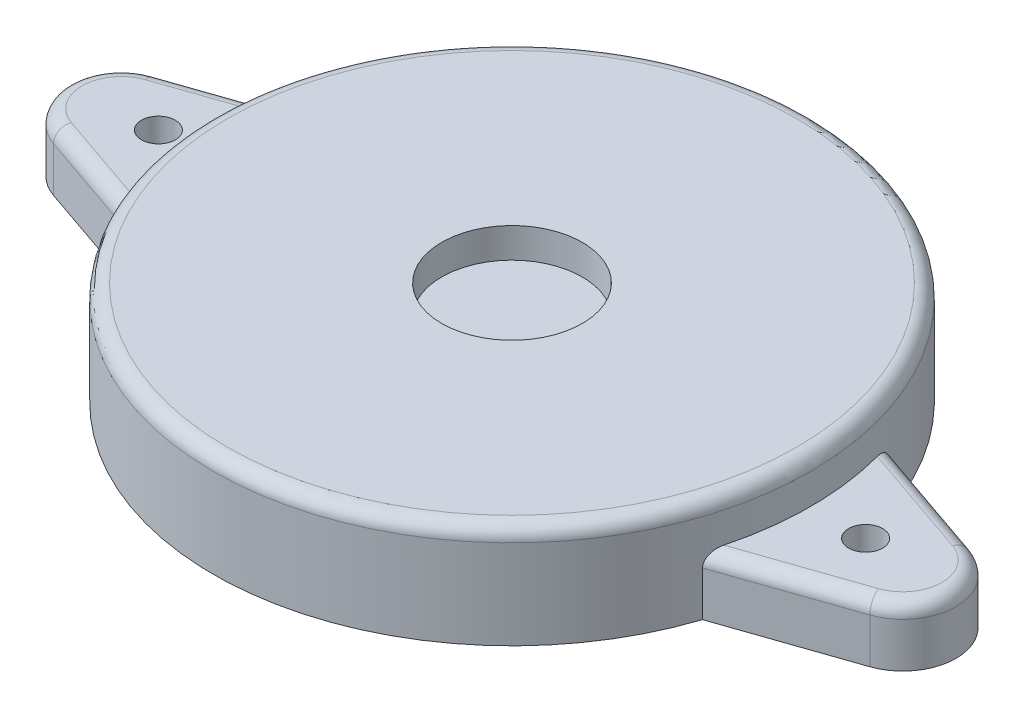
ISO-10303-21;
HEADER;
FILE_DESCRIPTION(('STEP AP214'),'2;1');
FILE_NAME('part.step','',(''),(''),'','','');
FILE_SCHEMA(('AUTOMOTIVE_DESIGN { 1 0 10303 214 1 1 1 1 }'));
ENDSEC;
DATA;
#1=APPLICATION_CONTEXT('core data for automotive mechanical design processes');
#2=APPLICATION_PROTOCOL_DEFINITION('international standard','automotive_design',2000,#1);
#3=PRODUCT_CONTEXT('',#1,'mechanical');
#4=PRODUCT('Part','Part','',(#3));
#5=PRODUCT_RELATED_PRODUCT_CATEGORY('part','',(#4));
#6=PRODUCT_DEFINITION_FORMATION('','',#4);
#7=PRODUCT_DEFINITION_CONTEXT('part definition',#1,'design');
#8=PRODUCT_DEFINITION('design','',#6,#7);
#9=PRODUCT_DEFINITION_SHAPE('','',#8);
#10=(LENGTH_UNIT() NAMED_UNIT(*) SI_UNIT(.MILLI.,.METRE.));
#11=(NAMED_UNIT(*) PLANE_ANGLE_UNIT() SI_UNIT($,.RADIAN.));
#12=(NAMED_UNIT(*) SI_UNIT($,.STERADIAN.) SOLID_ANGLE_UNIT());
#13=UNCERTAINTY_MEASURE_WITH_UNIT(LENGTH_MEASURE(1.E-05),#10,'distance_accuracy_value','');
#14=(GEOMETRIC_REPRESENTATION_CONTEXT(3) GLOBAL_UNCERTAINTY_ASSIGNED_CONTEXT((#13)) GLOBAL_UNIT_ASSIGNED_CONTEXT((#10,
#11,#12)) REPRESENTATION_CONTEXT('',''));
#15=CARTESIAN_POINT('',(0.,0.,0.));
#16=DIRECTION('',(0.,0.,1.));
#17=DIRECTION('',(1.,0.,0.));
#18=AXIS2_PLACEMENT_3D('',#15,#16,#17);
#19=CARTESIAN_POINT('',(0.,5.16,0.));
#20=DIRECTION('',(0.,-1.,0.));
#21=DIRECTION('',(0.,0.,-1.));
#22=AXIS2_PLACEMENT_3D('',#19,#20,#21);
#23=CYLINDRICAL_SURFACE('',#22,14.93);
#24=CARTESIAN_POINT('',(0.,4.46,0.));
#25=DIRECTION('',(0.,1.,0.));
#26=DIRECTION('',(0.,0.,1.));
#27=AXIS2_PLACEMENT_3D('',#24,#25,#26);
#28=CIRCLE('',#27,14.93);
#29=CARTESIAN_POINT('',(0.,4.46,14.93));
#30=VERTEX_POINT('',#29);
#31=EDGE_CURVE('E202',#30,#30,#28,.F.);
#32=ORIENTED_EDGE('',*,*,#31,.T.);
#33=EDGE_LOOP('',(#32));
#34=FACE_BOUND('',#33,.T.);
#35=CARTESIAN_POINT('',(0.,2.94,0.));
#36=DIRECTION('',(0.,-1.,0.));
#37=DIRECTION('',(0.,0.,-1.));
#38=AXIS2_PLACEMENT_3D('',#35,#36,#37);
#39=CIRCLE('',#38,14.93);
#40=CARTESIAN_POINT('',(-14.429087598297,2.94,3.8348834507287));
#41=VERTEX_POINT('',#40);
#42=CARTESIAN_POINT('',(-14.429087598297,2.94,-3.8348834507287));
#43=VERTEX_POINT('',#42);
#44=EDGE_CURVE('E163',#41,#43,#39,.T.);
#45=ORIENTED_EDGE('',*,*,#44,.F.);
#46=CARTESIAN_POINT('',(-14.429087598297,2.94,3.8348834507287));
#47=CARTESIAN_POINT('',(-14.4138774173166,2.93997814055828,3.8921743099573));
#48=CARTESIAN_POINT('',(-14.3982845537592,2.93480887956589,3.94941011262203));
#49=CARTESIAN_POINT('',(-14.3667965768096,2.91417210982097,4.06243771924972));
#50=CARTESIAN_POINT('',(-14.3509000239146,2.89861824672489,4.11821330467232));
#51=CARTESIAN_POINT('',(-14.3202531008862,2.85814754029159,4.22352402585155));
#52=CARTESIAN_POINT('',(-14.305483406981,2.83368591733759,4.2732273044714));
#53=CARTESIAN_POINT('',(-14.2771239902179,2.77541682636606,4.3670362653395));
#54=CARTESIAN_POINT('',(-14.2635295644546,2.74164911083228,4.41116461783673));
#55=CARTESIAN_POINT('',(-14.242478513252,2.67726120224456,4.47856390047529));
#56=CARTESIAN_POINT('',(-14.2344480605328,2.64907861241899,4.50399564814046));
#57=CARTESIAN_POINT('',(-14.219760478293,2.58871728969254,4.5501534800078));
#58=CARTESIAN_POINT('',(-14.2131033739341,2.5565384835928,4.57087947799488));
#59=CARTESIAN_POINT('',(-14.2015511147571,2.48845281904667,4.60664798740863));
#60=CARTESIAN_POINT('',(-14.1966728144079,2.45251425129202,4.6216361955794));
#61=CARTESIAN_POINT('',(-14.1892028208415,2.37825680983918,4.64452074193722));
#62=CARTESIAN_POINT('',(-14.1866043877521,2.33994531310194,4.65243798496127));
#63=CARTESIAN_POINT('',(-14.1849214181625,2.29108472920955,4.6575642029491));
#64=CARTESIAN_POINT('',(-14.1846584788022,2.28087987559489,4.6583649206828));
#65=CARTESIAN_POINT('',(-14.1843080413889,2.26045175313608,4.65943195312917));
#66=CARTESIAN_POINT('',(-14.184220329351,2.25022852203119,4.659698919651));
#67=CARTESIAN_POINT('',(-14.1842199529482,2.24,4.65970002536481));
#68=B_SPLINE_CURVE_WITH_KNOTS('',3,(#46,#47,#48,#49,#50,#51,#52,#53,#54,#55,#56,#57,#58,#59,#60,
#61,#62,#63,#64,#65,#66,#67),.UNSPECIFIED.,.F.,.F.,(4,2,2,2,2,2,2,2,2,2,4),(0.,
0.177689420451845,0.356875152519502,0.527957754312332,0.698320583460933,0.814287444919781,
0.930256430862166,1.04729732013803,1.16399102929701,1.19469972106421,1.22537088886555),.UNSPECIFIED.);
#69=CARTESIAN_POINT('',(-14.1842199529482,2.24,4.65970002536481));
#70=VERTEX_POINT('',#69);
#71=EDGE_CURVE('E46',#41,#70,#68,.T.);
#72=ORIENTED_EDGE('',*,*,#71,.T.);
#73=DIRECTION('',(0.,-1.,0.));
#74=VECTOR('',#73,1.);
#75=CARTESIAN_POINT('',(-14.1842199529482,2.94,4.65970002536481));
#76=LINE('',#75,#74);
#77=CARTESIAN_POINT('',(-14.1842199529482,0.,4.65970002536481));
#78=VERTEX_POINT('',#77);
#79=EDGE_CURVE('E138',#70,#78,#76,.T.);
#80=ORIENTED_EDGE('',*,*,#79,.T.);
#81=CARTESIAN_POINT('',(0.,0.,0.));
#82=DIRECTION('',(0.,1.,0.));
#83=DIRECTION('',(0.,0.,1.));
#84=AXIS2_PLACEMENT_3D('',#81,#82,#83);
#85=CIRCLE('',#84,14.93);
#86=CARTESIAN_POINT('',(14.1842199529483,0.,4.65970002536481));
#87=VERTEX_POINT('',#86);
#88=EDGE_CURVE('E150',#78,#87,#85,.T.);
#89=ORIENTED_EDGE('',*,*,#88,.T.);
#90=DIRECTION('',(0.,-1.,0.));
#91=VECTOR('',#90,1.);
#92=CARTESIAN_POINT('',(14.1842199529482,2.94,4.65970002536481));
#93=LINE('',#92,#91);
#94=CARTESIAN_POINT('',(14.1842199529482,2.24,4.65970002536481));
#95=VERTEX_POINT('',#94);
#96=EDGE_CURVE('E194',#95,#87,#93,.T.);
#97=ORIENTED_EDGE('',*,*,#96,.F.);
#98=CARTESIAN_POINT('',(14.1842199529482,2.24,4.65970002536481));
#99=CARTESIAN_POINT('',(14.1842190896717,2.25693649452195,4.65970201646287));
#100=CARTESIAN_POINT('',(14.184461026523,2.27386343904716,4.6589662491817));
#101=CARTESIAN_POINT('',(14.1854202016541,2.30756925031859,4.65604524308534));
#102=CARTESIAN_POINT('',(14.1861371831797,2.32434819209661,4.65386078726296));
#103=CARTESIAN_POINT('',(14.1889722437595,2.37406195090137,4.64521313316511));
#104=CARTESIAN_POINT('',(14.1917747600945,2.40661629321092,4.63665481022352));
#105=CARTESIAN_POINT('',(14.1989974675529,2.46965652039576,4.61448848816677));
#106=CARTESIAN_POINT('',(14.2034147720633,2.50014598190755,4.60088949919917));
#107=CARTESIAN_POINT('',(14.2135990146769,2.55856601677584,4.5693300993658));
#108=CARTESIAN_POINT('',(14.219367887,2.58649284229407,4.55136343655123));
#109=CARTESIAN_POINT('',(14.2324496611259,2.64139553893826,4.5102964837884));
#110=CARTESIAN_POINT('',(14.239847031579,2.66813434631393,4.48690821546017));
#111=CARTESIAN_POINT('',(14.255543759827,2.71792964715898,4.4367851705581));
#112=CARTESIAN_POINT('',(14.2638433119251,2.74098534474529,4.41004967290192));
#113=CARTESIAN_POINT('',(14.282757982286,2.78748441236427,4.34844257702542));
#114=CARTESIAN_POINT('',(14.2935083015561,2.81011977276594,4.3130029102126));
#115=CARTESIAN_POINT('',(14.3155306560991,2.84999580013863,4.23933536231764));
#116=CARTESIAN_POINT('',(14.326803306577,2.86722991003768,4.2011041611923));
#117=CARTESIAN_POINT('',(14.3516786781012,2.89899127627244,4.11540518367075));
#118=CARTESIAN_POINT('',(14.3653248558078,2.91241908179589,4.06754191138568));
#119=CARTESIAN_POINT('',(14.3924909249222,2.93160860206077,3.97034534492567));
#120=CARTESIAN_POINT('',(14.4060109908642,2.93738324223114,3.92101467352165));
#121=CARTESIAN_POINT('',(14.4225769534227,2.9397641173255,3.85931833082634));
#122=CARTESIAN_POINT('',(14.4258406872819,2.94000004110343,3.8471010798203));
#123=CARTESIAN_POINT('',(14.429087598297,2.94,3.8348834507287));
#124=B_SPLINE_CURVE_WITH_KNOTS('',3,(#98,#99,#100,#101,#102,#103,#104,#105,#106,#107,#108,#109,
#110,#111,#112,#113,#114,#115,#116,#117,#118,#119,#120,#121,#122,#123),.UNSPECIFIED.,.F.,.F.,(4,
2,2,2,2,2,2,2,2,2,2,2,4),(0.,0.0507734722109093,0.101519524519104,0.202294433131119,
0.302890069371643,0.403630556349275,0.512094664936698,0.620582179917424,0.750311736923561,
0.880198179861179,1.03423986539473,1.18802105701897,1.22595505623296),.UNSPECIFIED.);
#125=CARTESIAN_POINT('',(14.429087598297,2.94,3.8348834507287));
#126=VERTEX_POINT('',#125);
#127=EDGE_CURVE('E11',#95,#126,#124,.T.);
#128=ORIENTED_EDGE('',*,*,#127,.T.);
#129=CARTESIAN_POINT('',(0.,2.94,0.));
#130=DIRECTION('',(0.,-1.,0.));
#131=DIRECTION('',(0.,0.,1.));
#132=AXIS2_PLACEMENT_3D('',#129,#130,#131);
#133=CIRCLE('',#132,14.93);
#134=CARTESIAN_POINT('',(14.429087598297,2.94,-3.8348834507287));
#135=VERTEX_POINT('',#134);
#136=EDGE_CURVE('E177',#135,#126,#133,.T.);
#137=ORIENTED_EDGE('',*,*,#136,.F.);
#138=CARTESIAN_POINT('',(14.429087598297,2.94,-3.8348834507287));
#139=CARTESIAN_POINT('',(14.4138774173166,2.93997814055828,-3.8921743099573));
#140=CARTESIAN_POINT('',(14.3982845537592,2.93480887956589,-3.94941011262203));
#141=CARTESIAN_POINT('',(14.3667965768096,2.91417210982097,-4.06243771924972));
#142=CARTESIAN_POINT('',(14.3509000239146,2.89861824672489,-4.11821330467232));
#143=CARTESIAN_POINT('',(14.3202531008862,2.85814754029159,-4.22352402585155));
#144=CARTESIAN_POINT('',(14.305483406981,2.83368591733758,-4.2732273044714));
#145=CARTESIAN_POINT('',(14.2771239902179,2.77541682636606,-4.3670362653395));
#146=CARTESIAN_POINT('',(14.2635295644546,2.74164911083227,-4.41116461783674));
#147=CARTESIAN_POINT('',(14.242478513252,2.67726120224456,-4.47856390047529));
#148=CARTESIAN_POINT('',(14.2344480605328,2.64907861241899,-4.50399564814046));
#149=CARTESIAN_POINT('',(14.219760478293,2.58871728969254,-4.5501534800078));
#150=CARTESIAN_POINT('',(14.2131033739341,2.5565384835928,-4.57087947799488));
#151=CARTESIAN_POINT('',(14.2015511147571,2.48845281904666,-4.60664798740864));
#152=CARTESIAN_POINT('',(14.1966728144079,2.45251425129201,-4.6216361955794));
#153=CARTESIAN_POINT('',(14.1892028208415,2.37825680983918,-4.64452074193722));
#154=CARTESIAN_POINT('',(14.1866043877521,2.33994531310193,-4.65243798496127));
#155=CARTESIAN_POINT('',(14.1849214181625,2.29108472920955,-4.6575642029491));
#156=CARTESIAN_POINT('',(14.1846584788022,2.28087987559489,-4.6583649206828));
#157=CARTESIAN_POINT('',(14.1843080413889,2.26045175313608,-4.65943195312917));
#158=CARTESIAN_POINT('',(14.184220329351,2.25022852203119,-4.659698919651));
#159=CARTESIAN_POINT('',(14.1842199529482,2.24,-4.65970002536481));
#160=B_SPLINE_CURVE_WITH_KNOTS('',3,(#138,#139,#140,#141,#142,#143,#144,#145,#146,#147,#148,
#149,#150,#151,#152,#153,#154,#155,#156,#157,#158,#159),.UNSPECIFIED.,.F.,.F.,(4,2,2,2,2,2,2,2,
2,2,4),(0.,0.177689420451847,0.356875152519503,0.527957754312334,0.698320583460934,
0.814287444919785,0.930256430862171,1.04729732013804,1.16399102929701,1.19469972106422,
1.22537088886555),.UNSPECIFIED.);
#161=CARTESIAN_POINT('',(14.1842199529482,2.24,-4.65970002536481));
#162=VERTEX_POINT('',#161);
#163=EDGE_CURVE('E237',#135,#162,#160,.T.);
#164=ORIENTED_EDGE('',*,*,#163,.T.);
#165=DIRECTION('',(0.,-1.,0.));
#166=VECTOR('',#165,1.);
#167=CARTESIAN_POINT('',(14.1842199529482,2.94,-4.65970002536481));
#168=LINE('',#167,#166);
#169=CARTESIAN_POINT('',(14.1842199529482,0.,-4.65970002536481));
#170=VERTEX_POINT('',#169);
#171=EDGE_CURVE('E180',#162,#170,#168,.T.);
#172=ORIENTED_EDGE('',*,*,#171,.T.);
#173=CARTESIAN_POINT('',(-14.1842199529483,0.,-4.65970002536481));
#174=VERTEX_POINT('',#173);
#175=EDGE_CURVE('E196',#170,#174,#85,.T.);
#176=ORIENTED_EDGE('',*,*,#175,.T.);
#177=DIRECTION('',(0.,-1.,0.));
#178=VECTOR('',#177,1.);
#179=CARTESIAN_POINT('',(-14.1842199529482,2.94,-4.65970002536481));
#180=LINE('',#179,#178);
#181=CARTESIAN_POINT('',(-14.1842199529482,2.24,-4.65970002536481));
#182=VERTEX_POINT('',#181);
#183=EDGE_CURVE('E168',#182,#174,#180,.T.);
#184=ORIENTED_EDGE('',*,*,#183,.F.);
#185=CARTESIAN_POINT('',(-14.1842199529482,2.24,-4.65970002536481));
#186=CARTESIAN_POINT('',(-14.1842190896717,2.25693649452195,-4.65970201646287));
#187=CARTESIAN_POINT('',(-14.184461026523,2.27386343904716,-4.6589662491817));
#188=CARTESIAN_POINT('',(-14.1854202016541,2.30756925031859,-4.65604524308534));
#189=CARTESIAN_POINT('',(-14.1861371831797,2.32434819209661,-4.65386078726296));
#190=CARTESIAN_POINT('',(-14.1889722437595,2.37406195090137,-4.64521313316511));
#191=CARTESIAN_POINT('',(-14.1917747600945,2.40661629321092,-4.63665481022352));
#192=CARTESIAN_POINT('',(-14.1989974675529,2.46965652039576,-4.61448848816677));
#193=CARTESIAN_POINT('',(-14.2034147720633,2.50014598190755,-4.60088949919916));
#194=CARTESIAN_POINT('',(-14.2135990146769,2.55856601677584,-4.5693300993658));
#195=CARTESIAN_POINT('',(-14.219367887,2.58649284229407,-4.55136343655123));
#196=CARTESIAN_POINT('',(-14.2324496611259,2.64139553893826,-4.5102964837884));
#197=CARTESIAN_POINT('',(-14.239847031579,2.66813434631393,-4.48690821546017));
#198=CARTESIAN_POINT('',(-14.255543759827,2.71792964715898,-4.4367851705581));
#199=CARTESIAN_POINT('',(-14.2638433119251,2.74098534474529,-4.41004967290191));
#200=CARTESIAN_POINT('',(-14.282757982286,2.78748441236427,-4.34844257702541));
#201=CARTESIAN_POINT('',(-14.2935083015561,2.81011977276594,-4.3130029102126));
#202=CARTESIAN_POINT('',(-14.3155306560991,2.84999580013863,-4.23933536231764));
#203=CARTESIAN_POINT('',(-14.326803306577,2.86722991003768,-4.2011041611923));
#204=CARTESIAN_POINT('',(-14.3516786781012,2.89899127627244,-4.11540518367075));
#205=CARTESIAN_POINT('',(-14.3653248558078,2.91241908179589,-4.06754191138568));
#206=CARTESIAN_POINT('',(-14.3924909249222,2.93160860206077,-3.97034534492567));
#207=CARTESIAN_POINT('',(-14.4060109908642,2.93738324223114,-3.92101467352165));
#208=CARTESIAN_POINT('',(-14.4225769534227,2.9397641173255,-3.85931833082634));
#209=CARTESIAN_POINT('',(-14.4258406872819,2.94000004110343,-3.8471010798203));
#210=CARTESIAN_POINT('',(-14.429087598297,2.94,-3.8348834507287));
#211=B_SPLINE_CURVE_WITH_KNOTS('',3,(#185,#186,#187,#188,#189,#190,#191,#192,#193,#194,#195,
#196,#197,#198,#199,#200,#201,#202,#203,#204,#205,#206,#207,#208,#209,#210),.UNSPECIFIED.,.F.,
.F.,(4,2,2,2,2,2,2,2,2,2,2,2,4),(0.,0.0507734722109094,0.101519524519103,0.202294433131119,
0.302890069371642,0.403630556349275,0.512094664936698,0.620582179917423,0.75031173692356,
0.880198179861176,1.03423986539473,1.18802105701897,1.22595505623296),.UNSPECIFIED.);
#212=EDGE_CURVE('E229',#182,#43,#211,.T.);
#213=ORIENTED_EDGE('',*,*,#212,.T.);
#214=EDGE_LOOP('',(#45,#72,#80,#89,#97,#128,#137,#164,#172,#176,#184,#213));
#215=FACE_BOUND('',#214,.T.);
#216=ADVANCED_FACE('F36',(#34,#215),#23,.T.);
#217=CARTESIAN_POINT('',(0.,5.16,0.));
#218=DIRECTION('',(0.,1.,0.));
#219=DIRECTION('',(0.,0.,1.));
#220=AXIS2_PLACEMENT_3D('',#217,#218,#219);
#221=PLANE('',#220);
#222=CARTESIAN_POINT('',(0.,5.16,0.));
#223=DIRECTION('',(0.,1.,0.));
#224=DIRECTION('',(0.,0.,1.));
#225=AXIS2_PLACEMENT_3D('',#222,#223,#224);
#226=CIRCLE('',#225,3.515);
#227=CARTESIAN_POINT('',(0.,5.16,3.515));
#228=VERTEX_POINT('',#227);
#229=EDGE_CURVE('E285',#228,#228,#226,.T.);
#230=ORIENTED_EDGE('',*,*,#229,.F.);
#231=EDGE_LOOP('',(#230));
#232=FACE_BOUND('',#231,.T.);
#233=CARTESIAN_POINT('',(0.,5.16,0.));
#234=DIRECTION('',(0.,1.,0.));
#235=DIRECTION('',(0.,0.,1.));
#236=AXIS2_PLACEMENT_3D('',#233,#234,#235);
#237=CIRCLE('',#236,14.23);
#238=CARTESIAN_POINT('',(0.,5.16,14.23));
#239=VERTEX_POINT('',#238);
#240=EDGE_CURVE('E199',#239,#239,#237,.T.);
#241=ORIENTED_EDGE('',*,*,#240,.T.);
#242=EDGE_LOOP('',(#241));
#243=FACE_BOUND('',#242,.T.);
#244=ADVANCED_FACE('F310',(#232,#243),#221,.T.);
#245=CARTESIAN_POINT('',(0.,0.,0.));
#246=DIRECTION('',(0.,1.,0.));
#247=DIRECTION('',(0.,0.,1.));
#248=AXIS2_PLACEMENT_3D('',#245,#246,#247);
#249=PLANE('',#248);
#250=ORIENTED_EDGE('',*,*,#175,.F.);
#251=DIRECTION('',(-0.945415498264678,0.,-0.325867358968263));
#252=VECTOR('',#251,1.);
#253=CARTESIAN_POINT('',(14.1842199529482,0.,-4.65970002536481));
#254=LINE('',#253,#252);
#255=CARTESIAN_POINT('',(20.4067284526636,0.,-2.51491562667268));
#256=VERTEX_POINT('',#255);
#257=EDGE_CURVE('E181',#256,#170,#254,.T.);
#258=ORIENTED_EDGE('',*,*,#257,.F.);
#259=CARTESIAN_POINT('',(19.5398832245115,0.,0.));
#260=DIRECTION('',(0.,1.,0.));
#261=DIRECTION('',(0.,0.,1.));
#262=AXIS2_PLACEMENT_3D('',#259,#260,#261);
#263=CIRCLE('',#262,2.66011677541656);
#264=CARTESIAN_POINT('',(20.4067284526636,0.,2.51491562667268));
#265=VERTEX_POINT('',#264);
#266=EDGE_CURVE('E184',#265,#256,#263,.T.);
#267=ORIENTED_EDGE('',*,*,#266,.F.);
#268=DIRECTION('',(0.945415498264678,0.,-0.325867358968263));
#269=VECTOR('',#268,1.);
#270=CARTESIAN_POINT('',(14.1842199529482,0.,4.65970002536481));
#271=LINE('',#270,#269);
#272=EDGE_CURVE('E174',#87,#265,#271,.T.);
#273=ORIENTED_EDGE('',*,*,#272,.F.);
#274=ORIENTED_EDGE('',*,*,#88,.F.);
#275=DIRECTION('',(0.945415498264678,0.,0.325867358968263));
#276=VECTOR('',#275,1.);
#277=CARTESIAN_POINT('',(-14.1842199529482,0.,4.65970002536481));
#278=LINE('',#277,#276);
#279=CARTESIAN_POINT('',(-20.4067284526636,0.,2.51491562667268));
#280=VERTEX_POINT('',#279);
#281=EDGE_CURVE('E131',#280,#78,#278,.T.);
#282=ORIENTED_EDGE('',*,*,#281,.F.);
#283=CARTESIAN_POINT('',(-19.5398832245115,0.,0.));
#284=DIRECTION('',(0.,1.,0.));
#285=DIRECTION('',(0.,0.,-1.));
#286=AXIS2_PLACEMENT_3D('',#283,#284,#285);
#287=CIRCLE('',#286,2.66011677541656);
#288=CARTESIAN_POINT('',(-20.4067284526636,0.,-2.51491562667268));
#289=VERTEX_POINT('',#288);
#290=EDGE_CURVE('E147',#289,#280,#287,.T.);
#291=ORIENTED_EDGE('',*,*,#290,.F.);
#292=DIRECTION('',(-0.945415498264678,0.,0.325867358968263));
#293=VECTOR('',#292,1.);
#294=CARTESIAN_POINT('',(-14.1842199529482,0.,-4.65970002536481));
#295=LINE('',#294,#293);
#296=EDGE_CURVE('E151',#174,#289,#295,.T.);
#297=ORIENTED_EDGE('',*,*,#296,.F.);
#298=EDGE_LOOP('',(#250,#258,#267,#273,#274,#282,#291,#297));
#299=FACE_BOUND('',#298,.T.);
#300=CARTESIAN_POINT('',(17.679999999928,0.,0.));
#301=DIRECTION('',(0.,1.,0.));
#302=DIRECTION('',(0.,0.,1.));
#303=AXIS2_PLACEMENT_3D('',#300,#301,#302);
#304=CIRCLE('',#303,0.85);
#305=CARTESIAN_POINT('',(17.679999999928,0.,0.85));
#306=VERTEX_POINT('',#305);
#307=EDGE_CURVE('E137',#306,#306,#304,.T.);
#308=ORIENTED_EDGE('',*,*,#307,.T.);
#309=EDGE_LOOP('',(#308));
#310=FACE_BOUND('',#309,.T.);
#311=CARTESIAN_POINT('',(-17.679999999928,0.,0.));
#312=DIRECTION('',(0.,1.,0.));
#313=DIRECTION('',(0.,0.,-1.));
#314=AXIS2_PLACEMENT_3D('',#311,#312,#313);
#315=CIRCLE('',#314,0.85);
#316=CARTESIAN_POINT('',(-17.679999999928,0.,-0.849999999999999));
#317=VERTEX_POINT('',#316);
#318=EDGE_CURVE('E160',#317,#317,#315,.T.);
#319=ORIENTED_EDGE('',*,*,#318,.T.);
#320=EDGE_LOOP('',(#319));
#321=FACE_BOUND('',#320,.T.);
#322=ADVANCED_FACE('F144',(#299,#310,#321),#249,.F.);
#323=CARTESIAN_POINT('',(0.,2.94,0.));
#324=DIRECTION('',(0.,1.,0.));
#325=DIRECTION('',(0.,0.,1.));
#326=AXIS2_PLACEMENT_3D('',#323,#324,#325);
#327=PLANE('',#326);
#328=CARTESIAN_POINT('',(19.5398832245115,2.94,0.));
#329=DIRECTION('',(0.,1.,0.));
#330=DIRECTION('',(0.,0.,1.));
#331=AXIS2_PLACEMENT_3D('',#328,#329,#330);
#332=CIRCLE('',#331,1.96011677541656);
#333=CARTESIAN_POINT('',(20.1786213013859,2.94,1.8531247778874));
#334=VERTEX_POINT('',#333);
#335=CARTESIAN_POINT('',(20.1786213013859,2.94,-1.8531247778874));
#336=VERTEX_POINT('',#335);
#337=EDGE_CURVE('E218',#334,#336,#332,.T.);
#338=ORIENTED_EDGE('',*,*,#337,.T.);
#339=DIRECTION('',(-0.945415498264678,0.,-0.325867358968263));
#340=VECTOR('',#339,1.);
#341=CARTESIAN_POINT('',(13.9561128016705,2.94,-3.99790917657953));
#342=LINE('',#341,#340);
#343=EDGE_CURVE('E220',#336,#135,#342,.T.);
#344=ORIENTED_EDGE('',*,*,#343,.T.);
#345=ORIENTED_EDGE('',*,*,#136,.T.);
#346=DIRECTION('',(0.945415498264678,0.,-0.325867358968263));
#347=VECTOR('',#346,1.);
#348=CARTESIAN_POINT('',(20.1786213013859,2.94,1.8531247778874));
#349=LINE('',#348,#347);
#350=EDGE_CURVE('E216',#126,#334,#349,.T.);
#351=ORIENTED_EDGE('',*,*,#350,.T.);
#352=EDGE_LOOP('',(#338,#344,#345,#351));
#353=FACE_BOUND('',#352,.T.);
#354=CARTESIAN_POINT('',(17.679999999928,2.94,0.));
#355=DIRECTION('',(0.,1.,0.));
#356=DIRECTION('',(0.,0.,1.));
#357=AXIS2_PLACEMENT_3D('',#354,#355,#356);
#358=CIRCLE('',#357,0.85);
#359=CARTESIAN_POINT('',(17.679999999928,2.94,0.85));
#360=VERTEX_POINT('',#359);
#361=EDGE_CURVE('E171',#360,#360,#358,.T.);
#362=ORIENTED_EDGE('',*,*,#361,.F.);
#363=EDGE_LOOP('',(#362));
#364=FACE_BOUND('',#363,.T.);
#365=ADVANCED_FACE('F344',(#353,#364),#327,.T.);
#366=CARTESIAN_POINT('',(14.1842199529482,2.94,4.65970002536481));
#367=DIRECTION('',(-0.325867358968263,0.,-0.945415498264678));
#368=DIRECTION('',(-0.945415498264678,0.,0.325867358968263));
#369=AXIS2_PLACEMENT_3D('',#366,#367,#368);
#370=PLANE('',#369);
#371=DIRECTION('',(0.,-1.,0.));
#372=VECTOR('',#371,1.);
#373=CARTESIAN_POINT('',(20.4067284526636,2.94,2.51491562667268));
#374=LINE('',#373,#372);
#375=CARTESIAN_POINT('',(20.4067284526636,2.24,2.51491562667268));
#376=VERTEX_POINT('',#375);
#377=EDGE_CURVE('E192',#376,#265,#374,.T.);
#378=ORIENTED_EDGE('',*,*,#377,.F.);
#379=DIRECTION('',(0.945415498264678,0.,-0.325867358968263));
#380=VECTOR('',#379,1.);
#381=CARTESIAN_POINT('',(14.1842199529482,2.24,4.65970002536481));
#382=LINE('',#381,#380);
#383=EDGE_CURVE('E54',#376,#95,#382,.F.);
#384=ORIENTED_EDGE('',*,*,#383,.T.);
#385=ORIENTED_EDGE('',*,*,#96,.T.);
#386=ORIENTED_EDGE('',*,*,#272,.T.);
#387=EDGE_LOOP('',(#378,#384,#385,#386));
#388=FACE_BOUND('',#387,.T.);
#389=ADVANCED_FACE('F347',(#388),#370,.F.);
#390=CARTESIAN_POINT('',(19.5398832245115,2.94,0.));
#391=DIRECTION('',(0.,-1.,0.));
#392=DIRECTION('',(0.,0.,-1.));
#393=AXIS2_PLACEMENT_3D('',#390,#391,#392);
#394=CYLINDRICAL_SURFACE('',#393,2.66011677541656);
#395=DIRECTION('',(0.,-1.,0.));
#396=VECTOR('',#395,1.);
#397=CARTESIAN_POINT('',(20.4067284526636,2.94,-2.51491562667268));
#398=LINE('',#397,#396);
#399=CARTESIAN_POINT('',(20.4067284526636,2.24,-2.51491562667268));
#400=VERTEX_POINT('',#399);
#401=EDGE_CURVE('E190',#400,#256,#398,.T.);
#402=ORIENTED_EDGE('',*,*,#401,.F.);
#403=CARTESIAN_POINT('',(19.5398832245115,2.24,0.));
#404=DIRECTION('',(0.,1.,0.));
#405=DIRECTION('',(0.,0.,1.));
#406=AXIS2_PLACEMENT_3D('',#403,#404,#405);
#407=CIRCLE('',#406,2.66011677541656);
#408=EDGE_CURVE('E225',#400,#376,#407,.F.);
#409=ORIENTED_EDGE('',*,*,#408,.T.);
#410=ORIENTED_EDGE('',*,*,#377,.T.);
#411=ORIENTED_EDGE('',*,*,#266,.T.);
#412=EDGE_LOOP('',(#402,#409,#410,#411));
#413=FACE_BOUND('',#412,.T.);
#414=ADVANCED_FACE('F351',(#413),#394,.T.);
#415=CARTESIAN_POINT('',(14.1842199529482,2.94,-4.65970002536481));
#416=DIRECTION('',(-0.325867358968263,0.,0.945415498264678));
#417=DIRECTION('',(0.945415498264678,0.,0.325867358968263));
#418=AXIS2_PLACEMENT_3D('',#415,#416,#417);
#419=PLANE('',#418);
#420=ORIENTED_EDGE('',*,*,#171,.F.);
#421=DIRECTION('',(-0.945415498264678,0.,-0.325867358968263));
#422=VECTOR('',#421,1.);
#423=CARTESIAN_POINT('',(20.4067284526636,2.24,-2.51491562667268));
#424=LINE('',#423,#422);
#425=EDGE_CURVE('E223',#162,#400,#424,.F.);
#426=ORIENTED_EDGE('',*,*,#425,.T.);
#427=ORIENTED_EDGE('',*,*,#401,.T.);
#428=ORIENTED_EDGE('',*,*,#257,.T.);
#429=EDGE_LOOP('',(#420,#426,#427,#428));
#430=FACE_BOUND('',#429,.T.);
#431=ADVANCED_FACE('F338',(#430),#419,.F.);
#432=CARTESIAN_POINT('',(17.679999999928,2.94,0.));
#433=DIRECTION('',(0.,-1.,0.));
#434=DIRECTION('',(0.,0.,-1.));
#435=AXIS2_PLACEMENT_3D('',#432,#433,#434);
#436=CYLINDRICAL_SURFACE('',#435,0.85);
#437=ORIENTED_EDGE('',*,*,#361,.T.);
#438=EDGE_LOOP('',(#437));
#439=FACE_BOUND('',#438,.T.);
#440=ORIENTED_EDGE('',*,*,#307,.F.);
#441=EDGE_LOOP('',(#440));
#442=FACE_BOUND('',#441,.T.);
#443=ADVANCED_FACE('F331',(#439,#442),#436,.F.);
#444=CARTESIAN_POINT('',(-19.5398832245115,2.94,0.));
#445=DIRECTION('',(0.,-1.,0.));
#446=DIRECTION('',(0.,0.,-1.));
#447=AXIS2_PLACEMENT_3D('',#444,#445,#446);
#448=PLANE('',#447);
#449=ORIENTED_EDGE('',*,*,#44,.T.);
#450=DIRECTION('',(-0.945415498264678,0.,0.325867358968263));
#451=VECTOR('',#450,1.);
#452=CARTESIAN_POINT('',(-20.1786213013859,2.94,-1.8531247778874));
#453=LINE('',#452,#451);
#454=CARTESIAN_POINT('',(-20.1786213013859,2.94,-1.8531247778874));
#455=VERTEX_POINT('',#454);
#456=EDGE_CURVE('E209',#43,#455,#453,.T.);
#457=ORIENTED_EDGE('',*,*,#456,.T.);
#458=CARTESIAN_POINT('',(-19.5398832245115,2.94,0.));
#459=DIRECTION('',(0.,-1.,0.));
#460=DIRECTION('',(0.,0.,-1.));
#461=AXIS2_PLACEMENT_3D('',#458,#459,#460);
#462=CIRCLE('',#461,1.96011677541656);
#463=CARTESIAN_POINT('',(-20.1786213013859,2.94,1.8531247778874));
#464=VERTEX_POINT('',#463);
#465=EDGE_CURVE('E207',#455,#464,#462,.F.);
#466=ORIENTED_EDGE('',*,*,#465,.T.);
#467=DIRECTION('',(0.945415498264678,0.,0.325867358968263));
#468=VECTOR('',#467,1.);
#469=CARTESIAN_POINT('',(-20.1786213013859,2.94,1.8531247778874));
#470=LINE('',#469,#468);
#471=EDGE_CURVE('E205',#464,#41,#470,.T.);
#472=ORIENTED_EDGE('',*,*,#471,.T.);
#473=EDGE_LOOP('',(#449,#457,#466,#472));
#474=FACE_BOUND('',#473,.T.);
#475=CARTESIAN_POINT('',(-17.679999999928,2.94,0.));
#476=DIRECTION('',(0.,1.,0.));
#477=DIRECTION('',(0.,0.,-1.));
#478=AXIS2_PLACEMENT_3D('',#475,#476,#477);
#479=CIRCLE('',#478,0.85);
#480=CARTESIAN_POINT('',(-17.679999999928,2.94,-0.849999999999999));
#481=VERTEX_POINT('',#480);
#482=EDGE_CURVE('E157',#481,#481,#479,.T.);
#483=ORIENTED_EDGE('',*,*,#482,.F.);
#484=EDGE_LOOP('',(#483));
#485=FACE_BOUND('',#484,.T.);
#486=ADVANCED_FACE('F328',(#474,#485),#448,.F.);
#487=CARTESIAN_POINT('',(-19.5398832245115,2.94,0.));
#488=DIRECTION('',(0.,-1.,0.));
#489=DIRECTION('',(0.,0.,-1.));
#490=AXIS2_PLACEMENT_3D('',#487,#488,#489);
#491=CYLINDRICAL_SURFACE('',#490,2.66011677541656);
#492=DIRECTION('',(0.,-1.,0.));
#493=VECTOR('',#492,1.);
#494=CARTESIAN_POINT('',(-20.4067284526636,2.94,2.51491562667268));
#495=LINE('',#494,#493);
#496=CARTESIAN_POINT('',(-20.4067284526636,2.24,2.51491562667268));
#497=VERTEX_POINT('',#496);
#498=EDGE_CURVE('E128',#497,#280,#495,.T.);
#499=ORIENTED_EDGE('',*,*,#498,.F.);
#500=CARTESIAN_POINT('',(-19.5398832245115,2.24,0.));
#501=DIRECTION('',(0.,-1.,0.));
#502=DIRECTION('',(0.,0.,-1.));
#503=AXIS2_PLACEMENT_3D('',#500,#501,#502);
#504=CIRCLE('',#503,2.66011677541656);
#505=CARTESIAN_POINT('',(-20.4067284526636,2.24,-2.51491562667268));
#506=VERTEX_POINT('',#505);
#507=EDGE_CURVE('E214',#497,#506,#504,.T.);
#508=ORIENTED_EDGE('',*,*,#507,.T.);
#509=DIRECTION('',(0.,-1.,0.));
#510=VECTOR('',#509,1.);
#511=CARTESIAN_POINT('',(-20.4067284526636,2.94,-2.51491562667268));
#512=LINE('',#511,#510);
#513=EDGE_CURVE('E155',#506,#289,#512,.T.);
#514=ORIENTED_EDGE('',*,*,#513,.T.);
#515=ORIENTED_EDGE('',*,*,#290,.T.);
#516=EDGE_LOOP('',(#499,#508,#514,#515));
#517=FACE_BOUND('',#516,.T.);
#518=ADVANCED_FACE('F153',(#517),#491,.T.);
#519=CARTESIAN_POINT('',(-14.1842199529482,2.94,4.65970002536481));
#520=DIRECTION('',(0.325867358968263,0.,-0.945415498264678));
#521=DIRECTION('',(-0.945415498264678,0.,-0.325867358968263));
#522=AXIS2_PLACEMENT_3D('',#519,#520,#521);
#523=PLANE('',#522);
#524=ORIENTED_EDGE('',*,*,#79,.F.);
#525=DIRECTION('',(0.945415498264678,0.,0.325867358968263));
#526=VECTOR('',#525,1.);
#527=CARTESIAN_POINT('',(-14.1842199529482,2.24,4.65970002536481));
#528=LINE('',#527,#526);
#529=EDGE_CURVE('E133',#70,#497,#528,.F.);
#530=ORIENTED_EDGE('',*,*,#529,.T.);
#531=ORIENTED_EDGE('',*,*,#498,.T.);
#532=ORIENTED_EDGE('',*,*,#281,.T.);
#533=EDGE_LOOP('',(#524,#530,#531,#532));
#534=FACE_BOUND('',#533,.T.);
#535=ADVANCED_FACE('F130',(#534),#523,.F.);
#536=CARTESIAN_POINT('',(-14.1842199529482,2.94,-4.65970002536481));
#537=DIRECTION('',(0.325867358968263,0.,0.945415498264678));
#538=DIRECTION('',(0.945415498264678,0.,-0.325867358968263));
#539=AXIS2_PLACEMENT_3D('',#536,#537,#538);
#540=PLANE('',#539);
#541=ORIENTED_EDGE('',*,*,#513,.F.);
#542=DIRECTION('',(-0.945415498264678,0.,0.325867358968263));
#543=VECTOR('',#542,1.);
#544=CARTESIAN_POINT('',(-14.1842199529482,2.24,-4.65970002536481));
#545=LINE('',#544,#543);
#546=EDGE_CURVE('E212',#506,#182,#545,.F.);
#547=ORIENTED_EDGE('',*,*,#546,.T.);
#548=ORIENTED_EDGE('',*,*,#183,.T.);
#549=ORIENTED_EDGE('',*,*,#296,.T.);
#550=EDGE_LOOP('',(#541,#547,#548,#549));
#551=FACE_BOUND('',#550,.T.);
#552=ADVANCED_FACE('F297',(#551),#540,.F.);
#553=CARTESIAN_POINT('',(-17.679999999928,2.94,0.));
#554=DIRECTION('',(0.,-1.,0.));
#555=DIRECTION('',(0.,0.,-1.));
#556=AXIS2_PLACEMENT_3D('',#553,#554,#555);
#557=CYLINDRICAL_SURFACE('',#556,0.85);
#558=ORIENTED_EDGE('',*,*,#482,.T.);
#559=EDGE_LOOP('',(#558));
#560=FACE_BOUND('',#559,.T.);
#561=ORIENTED_EDGE('',*,*,#318,.F.);
#562=EDGE_LOOP('',(#561));
#563=FACE_BOUND('',#562,.T.);
#564=ADVANCED_FACE('F295',(#560,#563),#557,.F.);
#565=CARTESIAN_POINT('',(0.,4.46,0.));
#566=DIRECTION('',(0.,1.,0.));
#567=DIRECTION('',(0.,0.,1.));
#568=AXIS2_PLACEMENT_3D('',#565,#566,#567);
#569=TOROIDAL_SURFACE('',#568,14.23,0.7);
#570=ORIENTED_EDGE('',*,*,#31,.F.);
#571=EDGE_LOOP('',(#570));
#572=FACE_BOUND('',#571,.T.);
#573=ORIENTED_EDGE('',*,*,#240,.F.);
#574=EDGE_LOOP('',(#573));
#575=FACE_BOUND('',#574,.T.);
#576=ADVANCED_FACE('F253',(#572,#575),#569,.T.);
#577=CARTESIAN_POINT('',(-20.1786213013859,2.24,1.8531247778874));
#578=DIRECTION('',(0.945415498264678,0.,0.325867358968263));
#579=DIRECTION('',(0.325867358968263,0.,-0.945415498264678));
#580=AXIS2_PLACEMENT_3D('',#577,#578,#579);
#581=CYLINDRICAL_SURFACE('',#580,0.7);
#582=ORIENTED_EDGE('',*,*,#71,.F.);
#583=ORIENTED_EDGE('',*,*,#471,.F.);
#584=CARTESIAN_POINT('',(-20.1786213013859,2.24,1.8531247778874));
#585=DIRECTION('',(-0.945415498264678,0.,-0.325867358968262));
#586=DIRECTION('',(-0.325867358968262,0.,0.945415498264678));
#587=AXIS2_PLACEMENT_3D('',#584,#585,#586);
#588=CIRCLE('',#587,0.7);
#589=EDGE_CURVE('E274',#497,#464,#588,.T.);
#590=ORIENTED_EDGE('',*,*,#589,.F.);
#591=ORIENTED_EDGE('',*,*,#529,.F.);
#592=EDGE_LOOP('',(#582,#583,#590,#591));
#593=FACE_BOUND('',#592,.T.);
#594=ADVANCED_FACE('F256',(#593),#581,.T.);
#595=CARTESIAN_POINT('',(-19.5398832245115,2.24,0.));
#596=DIRECTION('',(0.,-1.,0.));
#597=DIRECTION('',(0.,0.,-1.));
#598=AXIS2_PLACEMENT_3D('',#595,#596,#597);
#599=TOROIDAL_SURFACE('',#598,1.96011677541656,0.7);
#600=ORIENTED_EDGE('',*,*,#589,.T.);
#601=ORIENTED_EDGE('',*,*,#465,.F.);
#602=CARTESIAN_POINT('',(-20.1786213013859,2.24,-1.8531247778874));
#603=DIRECTION('',(0.945415498264678,0.,-0.325867358968262));
#604=DIRECTION('',(-0.325867358968262,0.,-0.945415498264678));
#605=AXIS2_PLACEMENT_3D('',#602,#603,#604);
#606=CIRCLE('',#605,0.7);
#607=EDGE_CURVE('E272',#506,#455,#606,.T.);
#608=ORIENTED_EDGE('',*,*,#607,.F.);
#609=ORIENTED_EDGE('',*,*,#507,.F.);
#610=EDGE_LOOP('',(#600,#601,#608,#609));
#611=FACE_BOUND('',#610,.T.);
#612=ADVANCED_FACE('F251',(#611),#599,.T.);
#613=CARTESIAN_POINT('',(-20.1786213013859,2.24,-1.8531247778874));
#614=DIRECTION('',(-0.945415498264678,0.,0.325867358968263));
#615=DIRECTION('',(0.325867358968263,0.,0.945415498264678));
#616=AXIS2_PLACEMENT_3D('',#613,#614,#615);
#617=CYLINDRICAL_SURFACE('',#616,0.7);
#618=ORIENTED_EDGE('',*,*,#212,.F.);
#619=ORIENTED_EDGE('',*,*,#546,.F.);
#620=ORIENTED_EDGE('',*,*,#607,.T.);
#621=ORIENTED_EDGE('',*,*,#456,.F.);
#622=EDGE_LOOP('',(#618,#619,#620,#621));
#623=FACE_BOUND('',#622,.T.);
#624=ADVANCED_FACE('F247',(#623),#617,.T.);
#625=CARTESIAN_POINT('',(2.71366920296367,2.24,7.87297300892069));
#626=DIRECTION('',(-0.945415498264678,0.,0.325867358968263));
#627=DIRECTION('',(0.325867358968263,0.,0.945415498264678));
#628=AXIS2_PLACEMENT_3D('',#625,#626,#627);
#629=CYLINDRICAL_SURFACE('',#628,0.7);
#630=ORIENTED_EDGE('',*,*,#127,.F.);
#631=ORIENTED_EDGE('',*,*,#383,.F.);
#632=CARTESIAN_POINT('',(20.1786213013859,2.24,1.8531247778874));
#633=DIRECTION('',(0.945415498264678,0.,-0.325867358968263));
#634=DIRECTION('',(-0.325867358968263,0.,-0.945415498264678));
#635=AXIS2_PLACEMENT_3D('',#632,#633,#634);
#636=CIRCLE('',#635,0.7);
#637=EDGE_CURVE('E41',#334,#376,#636,.T.);
#638=ORIENTED_EDGE('',*,*,#637,.F.);
#639=ORIENTED_EDGE('',*,*,#350,.F.);
#640=EDGE_LOOP('',(#630,#631,#638,#639));
#641=FACE_BOUND('',#640,.T.);
#642=ADVANCED_FACE('F38',(#641),#629,.T.);
#643=CARTESIAN_POINT('',(19.5398832245115,2.24,0.));
#644=DIRECTION('',(0.,1.,0.));
#645=DIRECTION('',(0.,0.,1.));
#646=AXIS2_PLACEMENT_3D('',#643,#644,#645);
#647=TOROIDAL_SURFACE('',#646,1.96011677541656,0.7);
#648=ORIENTED_EDGE('',*,*,#637,.T.);
#649=ORIENTED_EDGE('',*,*,#408,.F.);
#650=CARTESIAN_POINT('',(20.1786213013859,2.24,-1.8531247778874));
#651=DIRECTION('',(-0.945415498264678,0.,-0.325867358968262));
#652=DIRECTION('',(-0.325867358968262,0.,0.945415498264678));
#653=AXIS2_PLACEMENT_3D('',#650,#651,#652);
#654=CIRCLE('',#653,0.7);
#655=EDGE_CURVE('E276',#336,#400,#654,.T.);
#656=ORIENTED_EDGE('',*,*,#655,.F.);
#657=ORIENTED_EDGE('',*,*,#337,.F.);
#658=EDGE_LOOP('',(#648,#649,#656,#657));
#659=FACE_BOUND('',#658,.T.);
#660=ADVANCED_FACE('F448',(#659),#647,.T.);
#661=CARTESIAN_POINT('',(2.71366920296367,2.24,-7.87297300892069));
#662=DIRECTION('',(0.945415498264678,0.,0.325867358968263));
#663=DIRECTION('',(0.325867358968263,0.,-0.945415498264678));
#664=AXIS2_PLACEMENT_3D('',#661,#662,#663);
#665=CYLINDRICAL_SURFACE('',#664,0.7);
#666=ORIENTED_EDGE('',*,*,#655,.T.);
#667=ORIENTED_EDGE('',*,*,#425,.F.);
#668=ORIENTED_EDGE('',*,*,#163,.F.);
#669=ORIENTED_EDGE('',*,*,#343,.F.);
#670=EDGE_LOOP('',(#666,#667,#668,#669));
#671=FACE_BOUND('',#670,.T.);
#672=ADVANCED_FACE('F261',(#671),#665,.T.);
#673=CARTESIAN_POINT('',(0.,3.66,0.));
#674=DIRECTION('',(0.,1.,0.));
#675=DIRECTION('',(0.,0.,1.));
#676=AXIS2_PLACEMENT_3D('',#673,#674,#675);
#677=CYLINDRICAL_SURFACE('',#676,3.515);
#678=CARTESIAN_POINT('',(0.,3.66,0.));
#679=DIRECTION('',(0.,1.,0.));
#680=DIRECTION('',(0.,0.,1.));
#681=AXIS2_PLACEMENT_3D('',#678,#679,#680);
#682=CIRCLE('',#681,3.515);
#683=CARTESIAN_POINT('',(0.,3.66,3.515));
#684=VERTEX_POINT('',#683);
#685=EDGE_CURVE('E278',#684,#684,#682,.T.);
#686=ORIENTED_EDGE('',*,*,#685,.F.);
#687=EDGE_LOOP('',(#686));
#688=FACE_BOUND('',#687,.T.);
#689=ORIENTED_EDGE('',*,*,#229,.T.);
#690=EDGE_LOOP('',(#689));
#691=FACE_BOUND('',#690,.T.);
#692=ADVANCED_FACE('F429',(#688,#691),#677,.F.);
#693=CARTESIAN_POINT('',(0.,3.66,0.));
#694=DIRECTION('',(0.,1.,0.));
#695=DIRECTION('',(0.,0.,1.));
#696=AXIS2_PLACEMENT_3D('',#693,#694,#695);
#697=PLANE('',#696);
#698=ORIENTED_EDGE('',*,*,#685,.T.);
#699=EDGE_LOOP('',(#698));
#700=FACE_BOUND('',#699,.T.);
#701=ADVANCED_FACE('F434',(#700),#697,.T.);
#702=CLOSED_SHELL('',(#216,#244,#322,#365,#389,#414,#431,#443,#486,#518,#535,#552,#564,#576,
#594,#612,#624,#642,#660,#672,#692,#701));
#703=MANIFOLD_SOLID_BREP('B2',#702);
#704=ADVANCED_BREP_SHAPE_REPRESENTATION('',(#18,#703),#14);
#705=SHAPE_DEFINITION_REPRESENTATION(#9,#704);
ENDSEC;
END-ISO-10303-21;
